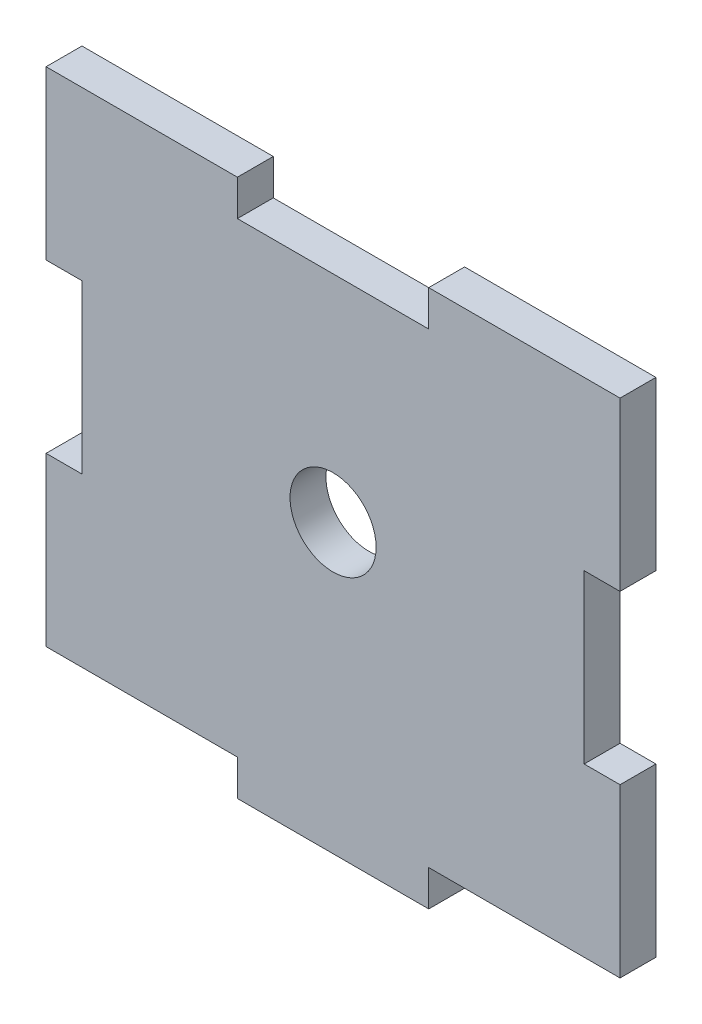
ISO-10303-21;
HEADER;
FILE_DESCRIPTION(('STEP AP214'),'2;1');
FILE_NAME('part.step','',(''),(''),'','','');
FILE_SCHEMA(('AUTOMOTIVE_DESIGN { 1 0 10303 214 1 1 1 1 }'));
ENDSEC;
DATA;
#1=APPLICATION_CONTEXT('core data for automotive mechanical design processes');
#2=APPLICATION_PROTOCOL_DEFINITION('international standard','automotive_design',2000,#1);
#3=PRODUCT_CONTEXT('',#1,'mechanical');
#4=PRODUCT('Part','Part','',(#3));
#5=PRODUCT_RELATED_PRODUCT_CATEGORY('part','',(#4));
#6=PRODUCT_DEFINITION_FORMATION('','',#4);
#7=PRODUCT_DEFINITION_CONTEXT('part definition',#1,'design');
#8=PRODUCT_DEFINITION('design','',#6,#7);
#9=PRODUCT_DEFINITION_SHAPE('','',#8);
#10=(LENGTH_UNIT() NAMED_UNIT(*) SI_UNIT(.MILLI.,.METRE.));
#11=(NAMED_UNIT(*) PLANE_ANGLE_UNIT() SI_UNIT($,.RADIAN.));
#12=(NAMED_UNIT(*) SI_UNIT($,.STERADIAN.) SOLID_ANGLE_UNIT());
#13=UNCERTAINTY_MEASURE_WITH_UNIT(LENGTH_MEASURE(1.E-05),#10,'distance_accuracy_value','');
#14=(GEOMETRIC_REPRESENTATION_CONTEXT(3) GLOBAL_UNCERTAINTY_ASSIGNED_CONTEXT((#13)) GLOBAL_UNIT_ASSIGNED_CONTEXT((#10,
#11,#12)) REPRESENTATION_CONTEXT('',''));
#15=CARTESIAN_POINT('',(0.,0.,0.));
#16=DIRECTION('',(0.,0.,1.));
#17=DIRECTION('',(1.,0.,0.));
#18=AXIS2_PLACEMENT_3D('',#15,#16,#17);
#19=CARTESIAN_POINT('',(0.,75.,5.));
#20=DIRECTION('',(0.,1.,0.));
#21=DIRECTION('',(-1.,0.,0.));
#22=AXIS2_PLACEMENT_3D('',#19,#20,#21);
#23=PLANE('',#22);
#24=DIRECTION('',(0.,0.,1.));
#25=VECTOR('',#24,1.);
#26=CARTESIAN_POINT('',(53.3333333333333,75.,-5.));
#27=LINE('',#26,#25);
#28=CARTESIAN_POINT('',(53.3333333333333,75.,0.));
#29=VERTEX_POINT('',#28);
#30=CARTESIAN_POINT('',(53.3333333333333,75.,5.));
#31=VERTEX_POINT('',#30);
#32=EDGE_CURVE('E298',#29,#31,#27,.T.);
#33=ORIENTED_EDGE('',*,*,#32,.T.);
#34=DIRECTION('',(1.,0.,0.));
#35=VECTOR('',#34,1.);
#36=CARTESIAN_POINT('',(0.,75.,5.));
#37=LINE('',#36,#35);
#38=CARTESIAN_POINT('',(80.,75.,5.));
#39=VERTEX_POINT('',#38);
#40=EDGE_CURVE('E183',#31,#39,#37,.T.);
#41=ORIENTED_EDGE('',*,*,#40,.T.);
#42=DIRECTION('',(0.,0.,-1.));
#43=VECTOR('',#42,1.);
#44=CARTESIAN_POINT('',(80.,75.,5.));
#45=LINE('',#44,#43);
#46=CARTESIAN_POINT('',(80.,75.,0.));
#47=VERTEX_POINT('',#46);
#48=EDGE_CURVE('E174',#39,#47,#45,.T.);
#49=ORIENTED_EDGE('',*,*,#48,.T.);
#50=DIRECTION('',(1.,0.,0.));
#51=VECTOR('',#50,1.);
#52=CARTESIAN_POINT('',(0.,75.,0.));
#53=LINE('',#52,#51);
#54=EDGE_CURVE('E233',#29,#47,#53,.T.);
#55=ORIENTED_EDGE('',*,*,#54,.F.);
#56=EDGE_LOOP('',(#33,#41,#49,#55));
#57=FACE_BOUND('',#56,.T.);
#58=ADVANCED_FACE('F35',(#57),#23,.T.);
#59=CARTESIAN_POINT('',(0.,0.,5.));
#60=DIRECTION('',(-1.,0.,0.));
#61=DIRECTION('',(0.,0.,1.));
#62=AXIS2_PLACEMENT_3D('',#59,#60,#61);
#63=PLANE('',#62);
#64=DIRECTION('',(0.,1.,0.));
#65=VECTOR('',#64,1.);
#66=CARTESIAN_POINT('',(0.,0.,0.));
#67=LINE('',#66,#65);
#68=CARTESIAN_POINT('',(0.,51.6666666666667,0.));
#69=VERTEX_POINT('',#68);
#70=CARTESIAN_POINT('',(0.,75.,0.));
#71=VERTEX_POINT('',#70);
#72=EDGE_CURVE('E197',#69,#71,#67,.T.);
#73=ORIENTED_EDGE('',*,*,#72,.F.);
#74=DIRECTION('',(0.,0.,-1.));
#75=VECTOR('',#74,1.);
#76=CARTESIAN_POINT('',(0.,51.6666666666667,5.));
#77=LINE('',#76,#75);
#78=CARTESIAN_POINT('',(0.,51.6666666666667,5.));
#79=VERTEX_POINT('',#78);
#80=EDGE_CURVE('E120',#79,#69,#77,.T.);
#81=ORIENTED_EDGE('',*,*,#80,.F.);
#82=DIRECTION('',(0.,1.,0.));
#83=VECTOR('',#82,1.);
#84=CARTESIAN_POINT('',(0.,0.,5.));
#85=LINE('',#84,#83);
#86=CARTESIAN_POINT('',(0.,75.,5.));
#87=VERTEX_POINT('',#86);
#88=EDGE_CURVE('E237',#79,#87,#85,.T.);
#89=ORIENTED_EDGE('',*,*,#88,.T.);
#90=DIRECTION('',(0.,0.,-1.));
#91=VECTOR('',#90,1.);
#92=CARTESIAN_POINT('',(0.,75.,5.));
#93=LINE('',#92,#91);
#94=EDGE_CURVE('E60',#87,#71,#93,.T.);
#95=ORIENTED_EDGE('',*,*,#94,.T.);
#96=EDGE_LOOP('',(#73,#81,#89,#95));
#97=FACE_BOUND('',#96,.T.);
#98=ADVANCED_FACE('F37',(#97),#63,.T.);
#99=CARTESIAN_POINT('',(0.,51.6666666666667,5.));
#100=DIRECTION('',(0.,1.,0.));
#101=DIRECTION('',(0.,0.,1.));
#102=AXIS2_PLACEMENT_3D('',#99,#100,#101);
#103=PLANE('',#102);
#104=DIRECTION('',(1.,0.,0.));
#105=VECTOR('',#104,1.);
#106=CARTESIAN_POINT('',(0.,51.6666666666667,0.));
#107=LINE('',#106,#105);
#108=CARTESIAN_POINT('',(5.,51.6666666666667,0.));
#109=VERTEX_POINT('',#108);
#110=EDGE_CURVE('E199',#69,#109,#107,.T.);
#111=ORIENTED_EDGE('',*,*,#110,.T.);
#112=DIRECTION('',(0.,0.,-1.));
#113=VECTOR('',#112,1.);
#114=CARTESIAN_POINT('',(5.,51.6666666666667,5.));
#115=LINE('',#114,#113);
#116=CARTESIAN_POINT('',(5.,51.6666666666667,5.));
#117=VERTEX_POINT('',#116);
#118=EDGE_CURVE('E265',#117,#109,#115,.T.);
#119=ORIENTED_EDGE('',*,*,#118,.F.);
#120=DIRECTION('',(1.,0.,0.));
#121=VECTOR('',#120,1.);
#122=CARTESIAN_POINT('',(0.,51.6666666666667,5.));
#123=LINE('',#122,#121);
#124=EDGE_CURVE('E302',#79,#117,#123,.T.);
#125=ORIENTED_EDGE('',*,*,#124,.F.);
#126=ORIENTED_EDGE('',*,*,#80,.T.);
#127=EDGE_LOOP('',(#111,#119,#125,#126));
#128=FACE_BOUND('',#127,.T.);
#129=ADVANCED_FACE('F351',(#128),#103,.F.);
#130=CARTESIAN_POINT('',(5.00000000000001,0.,5.));
#131=DIRECTION('',(1.,0.,0.));
#132=DIRECTION('',(0.,1.,0.));
#133=AXIS2_PLACEMENT_3D('',#130,#131,#132);
#134=PLANE('',#133);
#135=DIRECTION('',(0.,-1.,0.));
#136=VECTOR('',#135,1.);
#137=CARTESIAN_POINT('',(5.00000000000001,0.,0.));
#138=LINE('',#137,#136);
#139=CARTESIAN_POINT('',(5.,28.3333333333333,0.));
#140=VERTEX_POINT('',#139);
#141=EDGE_CURVE('E202',#109,#140,#138,.T.);
#142=ORIENTED_EDGE('',*,*,#141,.T.);
#143=DIRECTION('',(0.,0.,-1.));
#144=VECTOR('',#143,1.);
#145=CARTESIAN_POINT('',(5.,28.3333333333333,5.));
#146=LINE('',#145,#144);
#147=CARTESIAN_POINT('',(5.,28.3333333333333,5.));
#148=VERTEX_POINT('',#147);
#149=EDGE_CURVE('E263',#148,#140,#146,.T.);
#150=ORIENTED_EDGE('',*,*,#149,.F.);
#151=DIRECTION('',(0.,-1.,0.));
#152=VECTOR('',#151,1.);
#153=CARTESIAN_POINT('',(5.00000000000001,0.,5.));
#154=LINE('',#153,#152);
#155=EDGE_CURVE('E304',#117,#148,#154,.T.);
#156=ORIENTED_EDGE('',*,*,#155,.F.);
#157=ORIENTED_EDGE('',*,*,#118,.T.);
#158=EDGE_LOOP('',(#142,#150,#156,#157));
#159=FACE_BOUND('',#158,.T.);
#160=ADVANCED_FACE('F356',(#159),#134,.F.);
#161=CARTESIAN_POINT('',(0.,28.3333333333333,5.));
#162=DIRECTION('',(0.,1.,0.));
#163=DIRECTION('',(0.,0.,1.));
#164=AXIS2_PLACEMENT_3D('',#161,#162,#163);
#165=PLANE('',#164);
#166=DIRECTION('',(1.,0.,0.));
#167=VECTOR('',#166,1.);
#168=CARTESIAN_POINT('',(0.,28.3333333333333,0.));
#169=LINE('',#168,#167);
#170=CARTESIAN_POINT('',(0.,28.3333333333333,0.));
#171=VERTEX_POINT('',#170);
#172=EDGE_CURVE('E205',#171,#140,#169,.T.);
#173=ORIENTED_EDGE('',*,*,#172,.F.);
#174=DIRECTION('',(0.,0.,-1.));
#175=VECTOR('',#174,1.);
#176=CARTESIAN_POINT('',(0.,28.3333333333333,5.));
#177=LINE('',#176,#175);
#178=CARTESIAN_POINT('',(0.,28.3333333333333,5.));
#179=VERTEX_POINT('',#178);
#180=EDGE_CURVE('E261',#179,#171,#177,.T.);
#181=ORIENTED_EDGE('',*,*,#180,.F.);
#182=DIRECTION('',(1.,0.,0.));
#183=VECTOR('',#182,1.);
#184=CARTESIAN_POINT('',(0.,28.3333333333333,5.));
#185=LINE('',#184,#183);
#186=EDGE_CURVE('E306',#179,#148,#185,.T.);
#187=ORIENTED_EDGE('',*,*,#186,.T.);
#188=ORIENTED_EDGE('',*,*,#149,.T.);
#189=EDGE_LOOP('',(#173,#181,#187,#188));
#190=FACE_BOUND('',#189,.T.);
#191=ADVANCED_FACE('F403',(#190),#165,.T.);
#192=CARTESIAN_POINT('',(0.,0.,5.));
#193=DIRECTION('',(-1.,0.,0.));
#194=DIRECTION('',(0.,0.,1.));
#195=AXIS2_PLACEMENT_3D('',#192,#193,#194);
#196=PLANE('',#195);
#197=DIRECTION('',(0.,1.,0.));
#198=VECTOR('',#197,1.);
#199=CARTESIAN_POINT('',(0.,0.,0.));
#200=LINE('',#199,#198);
#201=CARTESIAN_POINT('',(0.,5.,0.));
#202=VERTEX_POINT('',#201);
#203=EDGE_CURVE('E208',#202,#171,#200,.T.);
#204=ORIENTED_EDGE('',*,*,#203,.F.);
#205=DIRECTION('',(0.,0.,-1.));
#206=VECTOR('',#205,1.);
#207=CARTESIAN_POINT('',(0.,5.,5.));
#208=LINE('',#207,#206);
#209=CARTESIAN_POINT('',(0.,5.,5.));
#210=VERTEX_POINT('',#209);
#211=EDGE_CURVE('E259',#210,#202,#208,.T.);
#212=ORIENTED_EDGE('',*,*,#211,.F.);
#213=DIRECTION('',(0.,1.,0.));
#214=VECTOR('',#213,1.);
#215=CARTESIAN_POINT('',(0.,0.,5.));
#216=LINE('',#215,#214);
#217=EDGE_CURVE('E309',#210,#179,#216,.T.);
#218=ORIENTED_EDGE('',*,*,#217,.T.);
#219=ORIENTED_EDGE('',*,*,#180,.T.);
#220=EDGE_LOOP('',(#204,#212,#218,#219));
#221=FACE_BOUND('',#220,.T.);
#222=ADVANCED_FACE('F400',(#221),#196,.T.);
#223=CARTESIAN_POINT('',(0.,5.,5.));
#224=DIRECTION('',(0.,1.,0.));
#225=DIRECTION('',(0.,0.,1.));
#226=AXIS2_PLACEMENT_3D('',#223,#224,#225);
#227=PLANE('',#226);
#228=DIRECTION('',(1.,0.,0.));
#229=VECTOR('',#228,1.);
#230=CARTESIAN_POINT('',(0.,5.,0.));
#231=LINE('',#230,#229);
#232=CARTESIAN_POINT('',(26.6666666666667,5.,0.));
#233=VERTEX_POINT('',#232);
#234=EDGE_CURVE('E211',#202,#233,#231,.T.);
#235=ORIENTED_EDGE('',*,*,#234,.T.);
#236=DIRECTION('',(0.,0.,-1.));
#237=VECTOR('',#236,1.);
#238=CARTESIAN_POINT('',(26.6666666666667,5.,5.));
#239=LINE('',#238,#237);
#240=CARTESIAN_POINT('',(26.6666666666667,5.,5.));
#241=VERTEX_POINT('',#240);
#242=EDGE_CURVE('E256',#241,#233,#239,.T.);
#243=ORIENTED_EDGE('',*,*,#242,.F.);
#244=DIRECTION('',(1.,0.,0.));
#245=VECTOR('',#244,1.);
#246=CARTESIAN_POINT('',(0.,5.,5.));
#247=LINE('',#246,#245);
#248=EDGE_CURVE('E312',#210,#241,#247,.T.);
#249=ORIENTED_EDGE('',*,*,#248,.F.);
#250=ORIENTED_EDGE('',*,*,#211,.T.);
#251=EDGE_LOOP('',(#235,#243,#249,#250));
#252=FACE_BOUND('',#251,.T.);
#253=ADVANCED_FACE('F388',(#252),#227,.F.);
#254=CARTESIAN_POINT('',(26.6666666666667,0.,5.));
#255=DIRECTION('',(1.,0.,0.));
#256=DIRECTION('',(0.,0.,-1.));
#257=AXIS2_PLACEMENT_3D('',#254,#255,#256);
#258=PLANE('',#257);
#259=DIRECTION('',(0.,-1.,0.));
#260=VECTOR('',#259,1.);
#261=CARTESIAN_POINT('',(26.6666666666667,0.,0.));
#262=LINE('',#261,#260);
#263=CARTESIAN_POINT('',(26.6666666666667,0.,0.));
#264=VERTEX_POINT('',#263);
#265=EDGE_CURVE('E213',#233,#264,#262,.T.);
#266=ORIENTED_EDGE('',*,*,#265,.T.);
#267=DIRECTION('',(0.,0.,-1.));
#268=VECTOR('',#267,1.);
#269=CARTESIAN_POINT('',(26.6666666666667,0.,5.));
#270=LINE('',#269,#268);
#271=CARTESIAN_POINT('',(26.6666666666667,0.,5.));
#272=VERTEX_POINT('',#271);
#273=EDGE_CURVE('E253',#272,#264,#270,.T.);
#274=ORIENTED_EDGE('',*,*,#273,.F.);
#275=DIRECTION('',(0.,-1.,0.));
#276=VECTOR('',#275,1.);
#277=CARTESIAN_POINT('',(26.6666666666667,0.,5.));
#278=LINE('',#277,#276);
#279=EDGE_CURVE('E314',#241,#272,#278,.T.);
#280=ORIENTED_EDGE('',*,*,#279,.F.);
#281=ORIENTED_EDGE('',*,*,#242,.T.);
#282=EDGE_LOOP('',(#266,#274,#280,#281));
#283=FACE_BOUND('',#282,.T.);
#284=ADVANCED_FACE('F395',(#283),#258,.F.);
#285=CARTESIAN_POINT('',(0.,0.,5.));
#286=DIRECTION('',(0.,1.,0.));
#287=DIRECTION('',(0.,0.,1.));
#288=AXIS2_PLACEMENT_3D('',#285,#286,#287);
#289=PLANE('',#288);
#290=DIRECTION('',(1.,0.,0.));
#291=VECTOR('',#290,1.);
#292=CARTESIAN_POINT('',(0.,0.,0.));
#293=LINE('',#292,#291);
#294=CARTESIAN_POINT('',(53.3333333333333,0.,0.));
#295=VERTEX_POINT('',#294);
#296=EDGE_CURVE('E216',#264,#295,#293,.T.);
#297=ORIENTED_EDGE('',*,*,#296,.T.);
#298=DIRECTION('',(0.,0.,-1.));
#299=VECTOR('',#298,1.);
#300=CARTESIAN_POINT('',(53.3333333333333,0.,5.));
#301=LINE('',#300,#299);
#302=CARTESIAN_POINT('',(53.3333333333333,0.,5.));
#303=VERTEX_POINT('',#302);
#304=EDGE_CURVE('E251',#303,#295,#301,.T.);
#305=ORIENTED_EDGE('',*,*,#304,.F.);
#306=DIRECTION('',(1.,0.,0.));
#307=VECTOR('',#306,1.);
#308=CARTESIAN_POINT('',(0.,0.,5.));
#309=LINE('',#308,#307);
#310=EDGE_CURVE('E317',#272,#303,#309,.T.);
#311=ORIENTED_EDGE('',*,*,#310,.F.);
#312=ORIENTED_EDGE('',*,*,#273,.T.);
#313=EDGE_LOOP('',(#297,#305,#311,#312));
#314=FACE_BOUND('',#313,.T.);
#315=ADVANCED_FACE('F391',(#314),#289,.F.);
#316=CARTESIAN_POINT('',(53.3333333333333,0.,5.));
#317=DIRECTION('',(1.,0.,0.));
#318=DIRECTION('',(0.,0.,-1.));
#319=AXIS2_PLACEMENT_3D('',#316,#317,#318);
#320=PLANE('',#319);
#321=DIRECTION('',(0.,-1.,0.));
#322=VECTOR('',#321,1.);
#323=CARTESIAN_POINT('',(53.3333333333333,0.,0.));
#324=LINE('',#323,#322);
#325=CARTESIAN_POINT('',(53.3333333333333,5.,0.));
#326=VERTEX_POINT('',#325);
#327=EDGE_CURVE('E219',#326,#295,#324,.T.);
#328=ORIENTED_EDGE('',*,*,#327,.F.);
#329=DIRECTION('',(0.,0.,-1.));
#330=VECTOR('',#329,1.);
#331=CARTESIAN_POINT('',(53.3333333333333,5.,5.));
#332=LINE('',#331,#330);
#333=CARTESIAN_POINT('',(53.3333333333333,5.,5.));
#334=VERTEX_POINT('',#333);
#335=EDGE_CURVE('E249',#334,#326,#332,.T.);
#336=ORIENTED_EDGE('',*,*,#335,.F.);
#337=DIRECTION('',(0.,-1.,0.));
#338=VECTOR('',#337,1.);
#339=CARTESIAN_POINT('',(53.3333333333333,0.,5.));
#340=LINE('',#339,#338);
#341=EDGE_CURVE('E319',#334,#303,#340,.T.);
#342=ORIENTED_EDGE('',*,*,#341,.T.);
#343=ORIENTED_EDGE('',*,*,#304,.T.);
#344=EDGE_LOOP('',(#328,#336,#342,#343));
#345=FACE_BOUND('',#344,.T.);
#346=ADVANCED_FACE('F386',(#345),#320,.T.);
#347=CARTESIAN_POINT('',(80.,5.,0.));
#348=VERTEX_POINT('',#347);
#349=EDGE_CURVE('E214',#326,#348,#231,.T.);
#350=ORIENTED_EDGE('',*,*,#349,.T.);
#351=DIRECTION('',(0.,0.,-1.));
#352=VECTOR('',#351,1.);
#353=CARTESIAN_POINT('',(80.,5.,5.));
#354=LINE('',#353,#352);
#355=CARTESIAN_POINT('',(80.,5.,5.));
#356=VERTEX_POINT('',#355);
#357=EDGE_CURVE('E246',#356,#348,#354,.T.);
#358=ORIENTED_EDGE('',*,*,#357,.F.);
#359=EDGE_CURVE('E315',#334,#356,#247,.T.);
#360=ORIENTED_EDGE('',*,*,#359,.F.);
#361=ORIENTED_EDGE('',*,*,#335,.T.);
#362=EDGE_LOOP('',(#350,#358,#360,#361));
#363=FACE_BOUND('',#362,.T.);
#364=ADVANCED_FACE('F382',(#363),#227,.F.);
#365=CARTESIAN_POINT('',(80.,0.,5.));
#366=DIRECTION('',(-1.,0.,0.));
#367=DIRECTION('',(0.,0.,1.));
#368=AXIS2_PLACEMENT_3D('',#365,#366,#367);
#369=PLANE('',#368);
#370=DIRECTION('',(0.,1.,0.));
#371=VECTOR('',#370,1.);
#372=CARTESIAN_POINT('',(80.,0.,0.));
#373=LINE('',#372,#371);
#374=CARTESIAN_POINT('',(80.,28.3333333333333,0.));
#375=VERTEX_POINT('',#374);
#376=EDGE_CURVE('E222',#348,#375,#373,.T.);
#377=ORIENTED_EDGE('',*,*,#376,.T.);
#378=DIRECTION('',(0.,0.,-1.));
#379=VECTOR('',#378,1.);
#380=CARTESIAN_POINT('',(80.,28.3333333333333,5.));
#381=LINE('',#380,#379);
#382=CARTESIAN_POINT('',(80.,28.3333333333333,5.));
#383=VERTEX_POINT('',#382);
#384=EDGE_CURVE('E243',#383,#375,#381,.T.);
#385=ORIENTED_EDGE('',*,*,#384,.F.);
#386=DIRECTION('',(0.,1.,0.));
#387=VECTOR('',#386,1.);
#388=CARTESIAN_POINT('',(80.,0.,5.));
#389=LINE('',#388,#387);
#390=EDGE_CURVE('E322',#356,#383,#389,.T.);
#391=ORIENTED_EDGE('',*,*,#390,.F.);
#392=ORIENTED_EDGE('',*,*,#357,.T.);
#393=EDGE_LOOP('',(#377,#385,#391,#392));
#394=FACE_BOUND('',#393,.T.);
#395=ADVANCED_FACE('F379',(#394),#369,.F.);
#396=CARTESIAN_POINT('',(0.,28.3333333333333,5.));
#397=DIRECTION('',(0.,-1.,0.));
#398=DIRECTION('',(1.,0.,0.));
#399=AXIS2_PLACEMENT_3D('',#396,#397,#398);
#400=PLANE('',#399);
#401=DIRECTION('',(-1.,0.,0.));
#402=VECTOR('',#401,1.);
#403=CARTESIAN_POINT('',(0.,28.3333333333333,0.));
#404=LINE('',#403,#402);
#405=CARTESIAN_POINT('',(75.,28.3333333333333,0.));
#406=VERTEX_POINT('',#405);
#407=EDGE_CURVE('E224',#375,#406,#404,.T.);
#408=ORIENTED_EDGE('',*,*,#407,.T.);
#409=DIRECTION('',(0.,0.,-1.));
#410=VECTOR('',#409,1.);
#411=CARTESIAN_POINT('',(75.,28.3333333333333,5.));
#412=LINE('',#411,#410);
#413=CARTESIAN_POINT('',(75.,28.3333333333333,5.));
#414=VERTEX_POINT('',#413);
#415=EDGE_CURVE('E241',#414,#406,#412,.T.);
#416=ORIENTED_EDGE('',*,*,#415,.F.);
#417=DIRECTION('',(-1.,0.,0.));
#418=VECTOR('',#417,1.);
#419=CARTESIAN_POINT('',(0.,28.3333333333333,5.));
#420=LINE('',#419,#418);
#421=EDGE_CURVE('E191',#383,#414,#420,.T.);
#422=ORIENTED_EDGE('',*,*,#421,.F.);
#423=ORIENTED_EDGE('',*,*,#384,.T.);
#424=EDGE_LOOP('',(#408,#416,#422,#423));
#425=FACE_BOUND('',#424,.T.);
#426=ADVANCED_FACE('F328',(#425),#400,.F.);
#427=CARTESIAN_POINT('',(75.,0.,5.));
#428=DIRECTION('',(1.,0.,0.));
#429=DIRECTION('',(0.,1.,0.));
#430=AXIS2_PLACEMENT_3D('',#427,#428,#429);
#431=PLANE('',#430);
#432=DIRECTION('',(0.,-1.,0.));
#433=VECTOR('',#432,1.);
#434=CARTESIAN_POINT('',(75.,0.,0.));
#435=LINE('',#434,#433);
#436=CARTESIAN_POINT('',(75.,51.6666666666667,0.));
#437=VERTEX_POINT('',#436);
#438=EDGE_CURVE('E227',#437,#406,#435,.T.);
#439=ORIENTED_EDGE('',*,*,#438,.F.);
#440=DIRECTION('',(0.,0.,-1.));
#441=VECTOR('',#440,1.);
#442=CARTESIAN_POINT('',(75.,51.6666666666667,5.));
#443=LINE('',#442,#441);
#444=CARTESIAN_POINT('',(75.,51.6666666666667,5.));
#445=VERTEX_POINT('',#444);
#446=EDGE_CURVE('E173',#445,#437,#443,.T.);
#447=ORIENTED_EDGE('',*,*,#446,.F.);
#448=DIRECTION('',(0.,-1.,0.));
#449=VECTOR('',#448,1.);
#450=CARTESIAN_POINT('',(75.,0.,5.));
#451=LINE('',#450,#449);
#452=EDGE_CURVE('E189',#445,#414,#451,.T.);
#453=ORIENTED_EDGE('',*,*,#452,.T.);
#454=ORIENTED_EDGE('',*,*,#415,.T.);
#455=EDGE_LOOP('',(#439,#447,#453,#454));
#456=FACE_BOUND('',#455,.T.);
#457=ADVANCED_FACE('F332',(#456),#431,.T.);
#458=CARTESIAN_POINT('',(0.,51.6666666666667,5.));
#459=DIRECTION('',(0.,-1.,0.));
#460=DIRECTION('',(0.,0.,-1.));
#461=AXIS2_PLACEMENT_3D('',#458,#459,#460);
#462=PLANE('',#461);
#463=DIRECTION('',(-1.,0.,0.));
#464=VECTOR('',#463,1.);
#465=CARTESIAN_POINT('',(0.,51.6666666666667,0.));
#466=LINE('',#465,#464);
#467=CARTESIAN_POINT('',(80.,51.6666666666667,0.));
#468=VERTEX_POINT('',#467);
#469=EDGE_CURVE('E169',#468,#437,#466,.T.);
#470=ORIENTED_EDGE('',*,*,#469,.F.);
#471=DIRECTION('',(0.,0.,-1.));
#472=VECTOR('',#471,1.);
#473=CARTESIAN_POINT('',(80.,51.6666666666667,5.));
#474=LINE('',#473,#472);
#475=CARTESIAN_POINT('',(80.,51.6666666666667,5.));
#476=VERTEX_POINT('',#475);
#477=EDGE_CURVE('E163',#476,#468,#474,.T.);
#478=ORIENTED_EDGE('',*,*,#477,.F.);
#479=DIRECTION('',(-1.,0.,0.));
#480=VECTOR('',#479,1.);
#481=CARTESIAN_POINT('',(0.,51.6666666666667,5.));
#482=LINE('',#481,#480);
#483=EDGE_CURVE('E167',#476,#445,#482,.T.);
#484=ORIENTED_EDGE('',*,*,#483,.T.);
#485=ORIENTED_EDGE('',*,*,#446,.T.);
#486=EDGE_LOOP('',(#470,#478,#484,#485));
#487=FACE_BOUND('',#486,.T.);
#488=ADVANCED_FACE('F165',(#487),#462,.T.);
#489=CARTESIAN_POINT('',(80.,0.,5.));
#490=DIRECTION('',(-1.,0.,0.));
#491=DIRECTION('',(0.,0.,1.));
#492=AXIS2_PLACEMENT_3D('',#489,#490,#491);
#493=PLANE('',#492);
#494=DIRECTION('',(0.,1.,0.));
#495=VECTOR('',#494,1.);
#496=CARTESIAN_POINT('',(80.,0.,0.));
#497=LINE('',#496,#495);
#498=EDGE_CURVE('E231',#468,#47,#497,.T.);
#499=ORIENTED_EDGE('',*,*,#498,.T.);
#500=ORIENTED_EDGE('',*,*,#48,.F.);
#501=DIRECTION('',(0.,1.,0.));
#502=VECTOR('',#501,1.);
#503=CARTESIAN_POINT('',(80.,0.,5.));
#504=LINE('',#503,#502);
#505=EDGE_CURVE('E178',#476,#39,#504,.T.);
#506=ORIENTED_EDGE('',*,*,#505,.F.);
#507=ORIENTED_EDGE('',*,*,#477,.T.);
#508=EDGE_LOOP('',(#499,#500,#506,#507));
#509=FACE_BOUND('',#508,.T.);
#510=ADVANCED_FACE('F179',(#509),#493,.F.);
#511=DIRECTION('',(0.,0.,1.));
#512=VECTOR('',#511,1.);
#513=CARTESIAN_POINT('',(26.6666666666667,75.,-5.));
#514=LINE('',#513,#512);
#515=CARTESIAN_POINT('',(26.6666666666667,75.,0.));
#516=VERTEX_POINT('',#515);
#517=CARTESIAN_POINT('',(26.6666666666667,75.,5.));
#518=VERTEX_POINT('',#517);
#519=EDGE_CURVE('E291',#516,#518,#514,.T.);
#520=ORIENTED_EDGE('',*,*,#519,.F.);
#521=EDGE_CURVE('E234',#71,#516,#53,.T.);
#522=ORIENTED_EDGE('',*,*,#521,.F.);
#523=ORIENTED_EDGE('',*,*,#94,.F.);
#524=EDGE_CURVE('E195',#87,#518,#37,.T.);
#525=ORIENTED_EDGE('',*,*,#524,.T.);
#526=EDGE_LOOP('',(#520,#522,#523,#525));
#527=FACE_BOUND('',#526,.T.);
#528=ADVANCED_FACE('F346',(#527),#23,.T.);
#529=CARTESIAN_POINT('',(0.,0.,5.));
#530=DIRECTION('',(0.,0.,1.));
#531=DIRECTION('',(1.,0.,0.));
#532=AXIS2_PLACEMENT_3D('',#529,#530,#531);
#533=PLANE('',#532);
#534=CARTESIAN_POINT('',(40.,40.,5.));
#535=DIRECTION('',(0.,0.,1.));
#536=DIRECTION('',(1.,0.,0.));
#537=AXIS2_PLACEMENT_3D('',#534,#535,#536);
#538=CIRCLE('',#537,6.);
#539=CARTESIAN_POINT('',(46.,40.,5.));
#540=VERTEX_POINT('',#539);
#541=EDGE_CURVE('E546',#540,#540,#538,.T.);
#542=ORIENTED_EDGE('',*,*,#541,.F.);
#543=EDGE_LOOP('',(#542));
#544=FACE_BOUND('',#543,.T.);
#545=DIRECTION('',(0.,1.,0.));
#546=VECTOR('',#545,1.);
#547=CARTESIAN_POINT('',(53.3333333333333,75.,5.));
#548=LINE('',#547,#546);
#549=CARTESIAN_POINT('',(53.3333333333333,70.,5.));
#550=VERTEX_POINT('',#549);
#551=EDGE_CURVE('E336',#550,#31,#548,.T.);
#552=ORIENTED_EDGE('',*,*,#551,.F.);
#553=DIRECTION('',(1.,0.,0.));
#554=VECTOR('',#553,1.);
#555=CARTESIAN_POINT('',(53.3333333333333,70.,5.));
#556=LINE('',#555,#554);
#557=CARTESIAN_POINT('',(26.6666666666667,70.,5.));
#558=VERTEX_POINT('',#557);
#559=EDGE_CURVE('E287',#558,#550,#556,.T.);
#560=ORIENTED_EDGE('',*,*,#559,.F.);
#561=DIRECTION('',(0.,-1.,0.));
#562=VECTOR('',#561,1.);
#563=CARTESIAN_POINT('',(26.6666666666667,75.,5.));
#564=LINE('',#563,#562);
#565=EDGE_CURVE('E549',#518,#558,#564,.T.);
#566=ORIENTED_EDGE('',*,*,#565,.F.);
#567=ORIENTED_EDGE('',*,*,#524,.F.);
#568=ORIENTED_EDGE('',*,*,#88,.F.);
#569=ORIENTED_EDGE('',*,*,#124,.T.);
#570=ORIENTED_EDGE('',*,*,#155,.T.);
#571=ORIENTED_EDGE('',*,*,#186,.F.);
#572=ORIENTED_EDGE('',*,*,#217,.F.);
#573=ORIENTED_EDGE('',*,*,#248,.T.);
#574=ORIENTED_EDGE('',*,*,#279,.T.);
#575=ORIENTED_EDGE('',*,*,#310,.T.);
#576=ORIENTED_EDGE('',*,*,#341,.F.);
#577=ORIENTED_EDGE('',*,*,#359,.T.);
#578=ORIENTED_EDGE('',*,*,#390,.T.);
#579=ORIENTED_EDGE('',*,*,#421,.T.);
#580=ORIENTED_EDGE('',*,*,#452,.F.);
#581=ORIENTED_EDGE('',*,*,#483,.F.);
#582=ORIENTED_EDGE('',*,*,#505,.T.);
#583=ORIENTED_EDGE('',*,*,#40,.F.);
#584=EDGE_LOOP('',(#552,#560,#566,#567,#568,#569,#570,#571,#572,#573,#574,#575,#576,#577,#578,
#579,#580,#581,#582,#583));
#585=FACE_BOUND('',#584,.T.);
#586=ADVANCED_FACE('F187',(#544,#585),#533,.T.);
#587=CARTESIAN_POINT('',(0.,0.,0.));
#588=DIRECTION('',(0.,0.,1.));
#589=DIRECTION('',(1.,0.,0.));
#590=AXIS2_PLACEMENT_3D('',#587,#588,#589);
#591=PLANE('',#590);
#592=CARTESIAN_POINT('',(40.,40.,0.));
#593=DIRECTION('',(0.,0.,1.));
#594=DIRECTION('',(1.,0.,0.));
#595=AXIS2_PLACEMENT_3D('',#592,#593,#594);
#596=CIRCLE('',#595,6.);
#597=CARTESIAN_POINT('',(46.,40.,0.));
#598=VERTEX_POINT('',#597);
#599=EDGE_CURVE('E39',#598,#598,#596,.T.);
#600=ORIENTED_EDGE('',*,*,#599,.T.);
#601=EDGE_LOOP('',(#600));
#602=FACE_BOUND('',#601,.T.);
#603=DIRECTION('',(1.,0.,0.));
#604=VECTOR('',#603,1.);
#605=CARTESIAN_POINT('',(0.,70.,0.));
#606=LINE('',#605,#604);
#607=CARTESIAN_POINT('',(26.6666666666667,70.,0.));
#608=VERTEX_POINT('',#607);
#609=CARTESIAN_POINT('',(53.3333333333333,70.,0.));
#610=VERTEX_POINT('',#609);
#611=EDGE_CURVE('E44',#608,#610,#606,.T.);
#612=ORIENTED_EDGE('',*,*,#611,.T.);
#613=DIRECTION('',(0.,1.,0.));
#614=VECTOR('',#613,1.);
#615=CARTESIAN_POINT('',(53.3333333333333,0.,0.));
#616=LINE('',#615,#614);
#617=EDGE_CURVE('E11',#610,#29,#616,.T.);
#618=ORIENTED_EDGE('',*,*,#617,.T.);
#619=ORIENTED_EDGE('',*,*,#54,.T.);
#620=ORIENTED_EDGE('',*,*,#498,.F.);
#621=ORIENTED_EDGE('',*,*,#469,.T.);
#622=ORIENTED_EDGE('',*,*,#438,.T.);
#623=ORIENTED_EDGE('',*,*,#407,.F.);
#624=ORIENTED_EDGE('',*,*,#376,.F.);
#625=ORIENTED_EDGE('',*,*,#349,.F.);
#626=ORIENTED_EDGE('',*,*,#327,.T.);
#627=ORIENTED_EDGE('',*,*,#296,.F.);
#628=ORIENTED_EDGE('',*,*,#265,.F.);
#629=ORIENTED_EDGE('',*,*,#234,.F.);
#630=ORIENTED_EDGE('',*,*,#203,.T.);
#631=ORIENTED_EDGE('',*,*,#172,.T.);
#632=ORIENTED_EDGE('',*,*,#141,.F.);
#633=ORIENTED_EDGE('',*,*,#110,.F.);
#634=ORIENTED_EDGE('',*,*,#72,.T.);
#635=ORIENTED_EDGE('',*,*,#521,.T.);
#636=DIRECTION('',(0.,-1.,0.));
#637=VECTOR('',#636,1.);
#638=CARTESIAN_POINT('',(26.6666666666667,0.,0.));
#639=LINE('',#638,#637);
#640=EDGE_CURVE('E269',#516,#608,#639,.T.);
#641=ORIENTED_EDGE('',*,*,#640,.T.);
#642=EDGE_LOOP('',(#612,#618,#619,#620,#621,#622,#623,#624,#625,#626,#627,#628,#629,#630,#631,
#632,#633,#634,#635,#641));
#643=FACE_BOUND('',#642,.T.);
#644=ADVANCED_FACE('F274',(#602,#643),#591,.F.);
#645=CARTESIAN_POINT('',(53.3333333333333,75.,-5.));
#646=DIRECTION('',(1.,0.,0.));
#647=DIRECTION('',(0.,0.,-1.));
#648=AXIS2_PLACEMENT_3D('',#645,#646,#647);
#649=PLANE('',#648);
#650=DIRECTION('',(0.,0.,1.));
#651=VECTOR('',#650,1.);
#652=CARTESIAN_POINT('',(53.3333333333333,70.,-5.));
#653=LINE('',#652,#651);
#654=EDGE_CURVE('E200',#610,#550,#653,.T.);
#655=ORIENTED_EDGE('',*,*,#654,.T.);
#656=ORIENTED_EDGE('',*,*,#551,.T.);
#657=ORIENTED_EDGE('',*,*,#32,.F.);
#658=ORIENTED_EDGE('',*,*,#617,.F.);
#659=EDGE_LOOP('',(#655,#656,#657,#658));
#660=FACE_BOUND('',#659,.T.);
#661=ADVANCED_FACE('F493',(#660),#649,.F.);
#662=CARTESIAN_POINT('',(53.3333333333333,70.,-5.));
#663=DIRECTION('',(0.,-1.,0.));
#664=DIRECTION('',(0.,0.,-1.));
#665=AXIS2_PLACEMENT_3D('',#662,#663,#664);
#666=PLANE('',#665);
#667=DIRECTION('',(0.,0.,1.));
#668=VECTOR('',#667,1.);
#669=CARTESIAN_POINT('',(26.6666666666667,70.,-5.));
#670=LINE('',#669,#668);
#671=EDGE_CURVE('E51',#608,#558,#670,.T.);
#672=ORIENTED_EDGE('',*,*,#671,.T.);
#673=ORIENTED_EDGE('',*,*,#559,.T.);
#674=ORIENTED_EDGE('',*,*,#654,.F.);
#675=ORIENTED_EDGE('',*,*,#611,.F.);
#676=EDGE_LOOP('',(#672,#673,#674,#675));
#677=FACE_BOUND('',#676,.T.);
#678=ADVANCED_FACE('F281',(#677),#666,.F.);
#679=CARTESIAN_POINT('',(26.6666666666667,75.,-5.));
#680=DIRECTION('',(-1.,0.,0.));
#681=DIRECTION('',(0.,0.,1.));
#682=AXIS2_PLACEMENT_3D('',#679,#680,#681);
#683=PLANE('',#682);
#684=ORIENTED_EDGE('',*,*,#519,.T.);
#685=ORIENTED_EDGE('',*,*,#565,.T.);
#686=ORIENTED_EDGE('',*,*,#671,.F.);
#687=ORIENTED_EDGE('',*,*,#640,.F.);
#688=EDGE_LOOP('',(#684,#685,#686,#687));
#689=FACE_BOUND('',#688,.T.);
#690=ADVANCED_FACE('F344',(#689),#683,.F.);
#691=CARTESIAN_POINT('',(40.,40.,-5.));
#692=DIRECTION('',(0.,0.,1.));
#693=DIRECTION('',(1.,0.,0.));
#694=AXIS2_PLACEMENT_3D('',#691,#692,#693);
#695=CYLINDRICAL_SURFACE('',#694,6.);
#696=ORIENTED_EDGE('',*,*,#541,.T.);
#697=EDGE_LOOP('',(#696));
#698=FACE_BOUND('',#697,.T.);
#699=ORIENTED_EDGE('',*,*,#599,.F.);
#700=EDGE_LOOP('',(#699));
#701=FACE_BOUND('',#700,.T.);
#702=ADVANCED_FACE('F514',(#698,#701),#695,.F.);
#703=CLOSED_SHELL('',(#58,#98,#129,#160,#191,#222,#253,#284,#315,#346,#364,#395,#426,#457,#488,
#510,#528,#586,#644,#661,#678,#690,#702));
#704=MANIFOLD_SOLID_BREP('B2',#703);
#705=ADVANCED_BREP_SHAPE_REPRESENTATION('',(#18,#704),#14);
#706=SHAPE_DEFINITION_REPRESENTATION(#9,#705);
ENDSEC;
END-ISO-10303-21;
